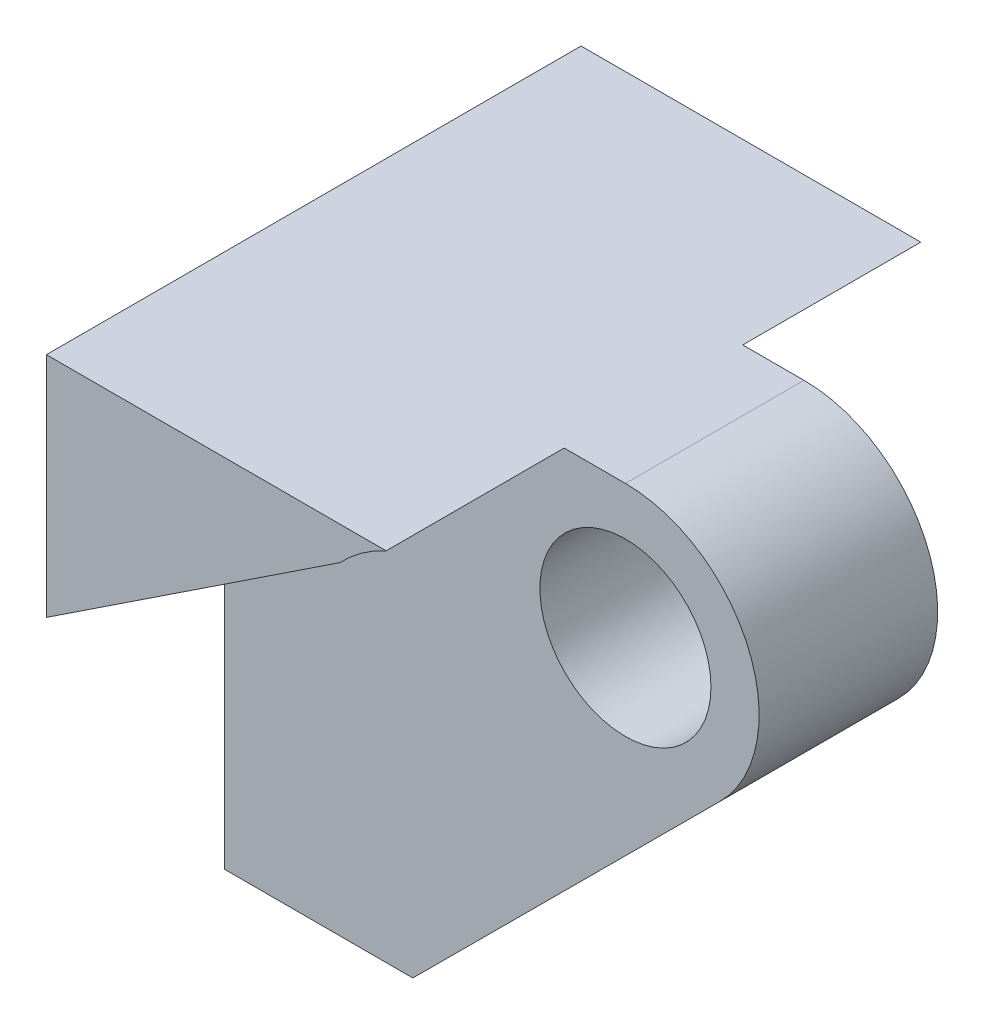
ISO-10303-21;
HEADER;
FILE_DESCRIPTION(('STEP AP214'),'2;1');
FILE_NAME('part.step','',(''),(''),'','','');
FILE_SCHEMA(('AUTOMOTIVE_DESIGN { 1 0 10303 214 1 1 1 1 }'));
ENDSEC;
DATA;
#1=APPLICATION_CONTEXT('core data for automotive mechanical design processes');
#2=APPLICATION_PROTOCOL_DEFINITION('international standard','automotive_design',2000,#1);
#3=PRODUCT_CONTEXT('',#1,'mechanical');
#4=PRODUCT('Part','Part','',(#3));
#5=PRODUCT_RELATED_PRODUCT_CATEGORY('part','',(#4));
#6=PRODUCT_DEFINITION_FORMATION('','',#4);
#7=PRODUCT_DEFINITION_CONTEXT('part definition',#1,'design');
#8=PRODUCT_DEFINITION('design','',#6,#7);
#9=PRODUCT_DEFINITION_SHAPE('','',#8);
#10=(LENGTH_UNIT() NAMED_UNIT(*) SI_UNIT(.MILLI.,.METRE.));
#11=(NAMED_UNIT(*) PLANE_ANGLE_UNIT() SI_UNIT($,.RADIAN.));
#12=(NAMED_UNIT(*) SI_UNIT($,.STERADIAN.) SOLID_ANGLE_UNIT());
#13=UNCERTAINTY_MEASURE_WITH_UNIT(LENGTH_MEASURE(1.E-05),#10,'distance_accuracy_value','');
#14=(GEOMETRIC_REPRESENTATION_CONTEXT(3) GLOBAL_UNCERTAINTY_ASSIGNED_CONTEXT((#13)) GLOBAL_UNIT_ASSIGNED_CONTEXT((#10,
#11,#12)) REPRESENTATION_CONTEXT('',''));
#15=CARTESIAN_POINT('',(0.,0.,0.));
#16=DIRECTION('',(0.,0.,1.));
#17=DIRECTION('',(1.,0.,0.));
#18=AXIS2_PLACEMENT_3D('',#15,#16,#17);
#19=CARTESIAN_POINT('',(0.,0.,5.));
#20=DIRECTION('',(0.,0.,-1.));
#21=DIRECTION('',(-1.,0.,0.));
#22=AXIS2_PLACEMENT_3D('',#19,#20,#21);
#23=CYLINDRICAL_SURFACE('',#22,2.5);
#24=CARTESIAN_POINT('',(0.,0.,1.67));
#25=DIRECTION('',(0.,0.,1.));
#26=DIRECTION('',(1.,0.,0.));
#27=AXIS2_PLACEMENT_3D('',#24,#25,#26);
#28=CIRCLE('',#27,2.5);
#29=CARTESIAN_POINT('',(1.76583977492671,-1.76969203232845,1.67));
#30=VERTEX_POINT('',#29);
#31=CARTESIAN_POINT('',(0.,2.5,1.67));
#32=VERTEX_POINT('',#31);
#33=EDGE_CURVE('E188',#30,#32,#28,.T.);
#34=ORIENTED_EDGE('',*,*,#33,.F.);
#35=DIRECTION('',(0.,0.,-1.));
#36=VECTOR('',#35,1.);
#37=CARTESIAN_POINT('',(1.76583977492671,-1.76969203232845,5.));
#38=LINE('',#37,#36);
#39=CARTESIAN_POINT('',(1.76583977492671,-1.76969203232845,-1.67));
#40=VERTEX_POINT('',#39);
#41=EDGE_CURVE('E195',#30,#40,#38,.T.);
#42=ORIENTED_EDGE('',*,*,#41,.T.);
#43=CARTESIAN_POINT('',(0.,0.,-1.67));
#44=DIRECTION('',(0.,0.,1.));
#45=DIRECTION('',(1.,0.,0.));
#46=AXIS2_PLACEMENT_3D('',#43,#44,#45);
#47=CIRCLE('',#46,2.5);
#48=CARTESIAN_POINT('',(0.,2.5,-1.67));
#49=VERTEX_POINT('',#48);
#50=EDGE_CURVE('E154',#40,#49,#47,.T.);
#51=ORIENTED_EDGE('',*,*,#50,.T.);
#52=DIRECTION('',(0.,0.,-1.));
#53=VECTOR('',#52,1.);
#54=CARTESIAN_POINT('',(0.,2.5,5.));
#55=LINE('',#54,#53);
#56=EDGE_CURVE('E203',#32,#49,#55,.T.);
#57=ORIENTED_EDGE('',*,*,#56,.F.);
#58=EDGE_LOOP('',(#34,#42,#51,#57));
#59=FACE_BOUND('',#58,.T.);
#60=ADVANCED_FACE('F33',(#59),#23,.T.);
#61=CARTESIAN_POINT('',(-7.5,-7.5,5.));
#62=DIRECTION('',(0.,1.,0.));
#63=DIRECTION('',(0.,0.,1.));
#64=AXIS2_PLACEMENT_3D('',#61,#62,#63);
#65=PLANE('',#64);
#66=DIRECTION('',(1.,0.,0.));
#67=VECTOR('',#66,1.);
#68=CARTESIAN_POINT('',(-7.5,-7.5,1.67));
#69=LINE('',#68,#67);
#70=CARTESIAN_POINT('',(-7.5,-7.5,1.67));
#71=VERTEX_POINT('',#70);
#72=CARTESIAN_POINT('',(-3.97696911247503,-7.5,1.67));
#73=VERTEX_POINT('',#72);
#74=EDGE_CURVE('E47',#71,#73,#69,.T.);
#75=ORIENTED_EDGE('',*,*,#74,.F.);
#76=DIRECTION('',(0.,0.,-1.));
#77=VECTOR('',#76,1.);
#78=CARTESIAN_POINT('',(-7.5,-7.5,5.));
#79=LINE('',#78,#77);
#80=CARTESIAN_POINT('',(-7.5,-7.5,-1.67));
#81=VERTEX_POINT('',#80);
#82=EDGE_CURVE('E199',#71,#81,#79,.T.);
#83=ORIENTED_EDGE('',*,*,#82,.T.);
#84=DIRECTION('',(1.,0.,0.));
#85=VECTOR('',#84,1.);
#86=CARTESIAN_POINT('',(-7.5,-7.5,-1.67));
#87=LINE('',#86,#85);
#88=CARTESIAN_POINT('',(-3.97696911247503,-7.5,-1.67));
#89=VERTEX_POINT('',#88);
#90=EDGE_CURVE('E150',#81,#89,#87,.T.);
#91=ORIENTED_EDGE('',*,*,#90,.T.);
#92=DIRECTION('',(0.,0.,-1.));
#93=VECTOR('',#92,1.);
#94=CARTESIAN_POINT('',(-3.97696911247503,-7.5,5.));
#95=LINE('',#94,#93);
#96=EDGE_CURVE('E197',#73,#89,#95,.T.);
#97=ORIENTED_EDGE('',*,*,#96,.F.);
#98=EDGE_LOOP('',(#75,#83,#91,#97));
#99=FACE_BOUND('',#98,.T.);
#100=ADVANCED_FACE('F240',(#99),#65,.F.);
#101=CARTESIAN_POINT('',(-3.97696911247503,-7.5,5.));
#102=DIRECTION('',(-0.706335909970683,0.70787681293138,0.));
#103=DIRECTION('',(-0.70787681293138,-0.706335909970683,0.));
#104=AXIS2_PLACEMENT_3D('',#101,#102,#103);
#105=PLANE('',#104);
#106=DIRECTION('',(0.70787681293138,0.706335909970683,0.));
#107=VECTOR('',#106,1.);
#108=CARTESIAN_POINT('',(-3.97696911247503,-7.5,1.67));
#109=LINE('',#108,#107);
#110=EDGE_CURVE('E183',#73,#30,#109,.T.);
#111=ORIENTED_EDGE('',*,*,#110,.F.);
#112=ORIENTED_EDGE('',*,*,#96,.T.);
#113=DIRECTION('',(0.70787681293138,0.706335909970683,0.));
#114=VECTOR('',#113,1.);
#115=CARTESIAN_POINT('',(-3.97696911247503,-7.5,-1.67));
#116=LINE('',#115,#114);
#117=EDGE_CURVE('E147',#89,#40,#116,.T.);
#118=ORIENTED_EDGE('',*,*,#117,.T.);
#119=ORIENTED_EDGE('',*,*,#41,.F.);
#120=EDGE_LOOP('',(#111,#112,#118,#119));
#121=FACE_BOUND('',#120,.T.);
#122=ADVANCED_FACE('F245',(#121),#105,.F.);
#123=CARTESIAN_POINT('',(0.,0.,5.));
#124=DIRECTION('',(0.,0.,-1.));
#125=DIRECTION('',(-1.,0.,0.));
#126=AXIS2_PLACEMENT_3D('',#123,#124,#125);
#127=CYLINDRICAL_SURFACE('',#126,1.6);
#128=CARTESIAN_POINT('',(0.,0.,1.67));
#129=DIRECTION('',(0.,0.,1.));
#130=DIRECTION('',(1.,0.,0.));
#131=AXIS2_PLACEMENT_3D('',#128,#129,#130);
#132=CIRCLE('',#131,1.6);
#133=CARTESIAN_POINT('',(1.6,0.,1.67));
#134=VERTEX_POINT('',#133);
#135=EDGE_CURVE('E182',#134,#134,#132,.T.);
#136=ORIENTED_EDGE('',*,*,#135,.T.);
#137=EDGE_LOOP('',(#136));
#138=FACE_BOUND('',#137,.T.);
#139=CARTESIAN_POINT('',(0.,0.,-1.67));
#140=DIRECTION('',(0.,0.,1.));
#141=DIRECTION('',(1.,0.,0.));
#142=AXIS2_PLACEMENT_3D('',#139,#140,#141);
#143=CIRCLE('',#142,1.6);
#144=CARTESIAN_POINT('',(1.6,0.,-1.67));
#145=VERTEX_POINT('',#144);
#146=EDGE_CURVE('E137',#145,#145,#143,.T.);
#147=ORIENTED_EDGE('',*,*,#146,.F.);
#148=EDGE_LOOP('',(#147));
#149=FACE_BOUND('',#148,.T.);
#150=ADVANCED_FACE('F255',(#138,#149),#127,.F.);
#151=CARTESIAN_POINT('',(0.,0.,5.));
#152=DIRECTION('',(0.,0.,1.));
#153=DIRECTION('',(1.,0.,0.));
#154=AXIS2_PLACEMENT_3D('',#151,#152,#153);
#155=PLANE('',#154);
#156=CARTESIAN_POINT('',(0.,0.,5.));
#157=DIRECTION('',(0.,0.,1.));
#158=DIRECTION('',(1.,0.,0.));
#159=AXIS2_PLACEMENT_3D('',#156,#157,#158);
#160=CIRCLE('',#159,2.75);
#161=CARTESIAN_POINT('',(-1.14564392373896,2.5,5.));
#162=VERTEX_POINT('',#161);
#163=CARTESIAN_POINT('',(-2.0105472316259,1.876219557888,5.));
#164=VERTEX_POINT('',#163);
#165=EDGE_CURVE('E170',#162,#164,#160,.T.);
#166=ORIENTED_EDGE('',*,*,#165,.F.);
#167=DIRECTION('',(-1.,0.,0.));
#168=VECTOR('',#167,1.);
#169=CARTESIAN_POINT('',(0.,2.5,5.));
#170=LINE('',#169,#168);
#171=CARTESIAN_POINT('',(-7.5,2.5,5.));
#172=VERTEX_POINT('',#171);
#173=EDGE_CURVE('E55',#162,#172,#170,.T.);
#174=ORIENTED_EDGE('',*,*,#173,.T.);
#175=DIRECTION('',(0.,-1.,0.));
#176=VECTOR('',#175,1.);
#177=CARTESIAN_POINT('',(-7.5,2.5,5.));
#178=LINE('',#177,#176);
#179=CARTESIAN_POINT('',(-7.5,-1.7558069392566,5.));
#180=VERTEX_POINT('',#179);
#181=EDGE_CURVE('E193',#172,#180,#178,.T.);
#182=ORIENTED_EDGE('',*,*,#181,.T.);
#183=DIRECTION('',(-0.833981117421096,-0.55179298272546,0.));
#184=VECTOR('',#183,1.);
#185=CARTESIAN_POINT('',(-8.51018569673159,-2.42418343731185,5.));
#186=LINE('',#185,#184);
#187=EDGE_CURVE('E174',#164,#180,#186,.T.);
#188=ORIENTED_EDGE('',*,*,#187,.F.);
#189=EDGE_LOOP('',(#166,#174,#182,#188));
#190=FACE_BOUND('',#189,.T.);
#191=ADVANCED_FACE('F215',(#190),#155,.T.);
#192=CARTESIAN_POINT('',(0.,2.5,5.));
#193=DIRECTION('',(0.,-1.,0.));
#194=DIRECTION('',(1.,0.,0.));
#195=AXIS2_PLACEMENT_3D('',#192,#193,#194);
#196=PLANE('',#195);
#197=ORIENTED_EDGE('',*,*,#173,.F.);
#198=DIRECTION('',(0.,0.,1.));
#199=VECTOR('',#198,1.);
#200=CARTESIAN_POINT('',(-1.14564392373896,2.5,1.67));
#201=LINE('',#200,#199);
#202=CARTESIAN_POINT('',(-1.14564392373896,2.5,1.67));
#203=VERTEX_POINT('',#202);
#204=EDGE_CURVE('E11',#162,#203,#201,.F.);
#205=ORIENTED_EDGE('',*,*,#204,.T.);
#206=DIRECTION('',(-1.,0.,0.));
#207=VECTOR('',#206,1.);
#208=CARTESIAN_POINT('',(0.,2.5,1.67));
#209=LINE('',#208,#207);
#210=EDGE_CURVE('E190',#32,#203,#209,.T.);
#211=ORIENTED_EDGE('',*,*,#210,.F.);
#212=ORIENTED_EDGE('',*,*,#56,.T.);
#213=DIRECTION('',(-1.,0.,0.));
#214=VECTOR('',#213,1.);
#215=CARTESIAN_POINT('',(0.,2.5,-1.67));
#216=LINE('',#215,#214);
#217=CARTESIAN_POINT('',(-1.14564392373896,2.5,-1.67));
#218=VERTEX_POINT('',#217);
#219=EDGE_CURVE('E157',#49,#218,#216,.T.);
#220=ORIENTED_EDGE('',*,*,#219,.T.);
#221=DIRECTION('',(0.,0.,-1.));
#222=VECTOR('',#221,1.);
#223=CARTESIAN_POINT('',(-1.14564392373896,2.5,-1.67));
#224=LINE('',#223,#222);
#225=CARTESIAN_POINT('',(-1.14564392373896,2.5,-5.));
#226=VERTEX_POINT('',#225);
#227=EDGE_CURVE('E140',#226,#218,#224,.F.);
#228=ORIENTED_EDGE('',*,*,#227,.F.);
#229=DIRECTION('',(-1.,0.,0.));
#230=VECTOR('',#229,1.);
#231=CARTESIAN_POINT('',(0.,2.5,-5.));
#232=LINE('',#231,#230);
#233=CARTESIAN_POINT('',(-7.5,2.5,-5.));
#234=VERTEX_POINT('',#233);
#235=EDGE_CURVE('E159',#226,#234,#232,.T.);
#236=ORIENTED_EDGE('',*,*,#235,.T.);
#237=DIRECTION('',(0.,0.,-1.));
#238=VECTOR('',#237,1.);
#239=CARTESIAN_POINT('',(-7.5,2.5,5.));
#240=LINE('',#239,#238);
#241=EDGE_CURVE('E201',#172,#234,#240,.T.);
#242=ORIENTED_EDGE('',*,*,#241,.F.);
#243=EDGE_LOOP('',(#197,#205,#211,#212,#220,#228,#236,#242));
#244=FACE_BOUND('',#243,.T.);
#245=ADVANCED_FACE('F223',(#244),#196,.F.);
#246=CARTESIAN_POINT('',(-7.5,2.5,5.));
#247=DIRECTION('',(1.,0.,0.));
#248=DIRECTION('',(0.,1.,0.));
#249=AXIS2_PLACEMENT_3D('',#246,#247,#248);
#250=PLANE('',#249);
#251=DIRECTION('',(0.,-1.,0.));
#252=VECTOR('',#251,1.);
#253=CARTESIAN_POINT('',(-7.5,2.5,1.67));
#254=LINE('',#253,#252);
#255=CARTESIAN_POINT('',(-7.5,-1.7558069392566,1.67));
#256=VERTEX_POINT('',#255);
#257=EDGE_CURVE('E186',#256,#71,#254,.T.);
#258=ORIENTED_EDGE('',*,*,#257,.F.);
#259=DIRECTION('',(0.,0.,1.));
#260=VECTOR('',#259,1.);
#261=CARTESIAN_POINT('',(-7.5,-1.7558069392566,5.));
#262=LINE('',#261,#260);
#263=EDGE_CURVE('E40',#256,#180,#262,.T.);
#264=ORIENTED_EDGE('',*,*,#263,.T.);
#265=ORIENTED_EDGE('',*,*,#181,.F.);
#266=ORIENTED_EDGE('',*,*,#241,.T.);
#267=DIRECTION('',(0.,-1.,0.));
#268=VECTOR('',#267,1.);
#269=CARTESIAN_POINT('',(-7.5,2.5,-5.));
#270=LINE('',#269,#268);
#271=CARTESIAN_POINT('',(-7.5,-1.7558069392566,-5.));
#272=VERTEX_POINT('',#271);
#273=EDGE_CURVE('E162',#234,#272,#270,.T.);
#274=ORIENTED_EDGE('',*,*,#273,.T.);
#275=DIRECTION('',(0.,0.,-1.));
#276=VECTOR('',#275,1.);
#277=CARTESIAN_POINT('',(-7.5,-1.7558069392566,-5.));
#278=LINE('',#277,#276);
#279=CARTESIAN_POINT('',(-7.5,-1.7558069392566,-1.67));
#280=VERTEX_POINT('',#279);
#281=EDGE_CURVE('E165',#280,#272,#278,.T.);
#282=ORIENTED_EDGE('',*,*,#281,.F.);
#283=DIRECTION('',(0.,-1.,0.));
#284=VECTOR('',#283,1.);
#285=CARTESIAN_POINT('',(-7.5,2.5,-1.67));
#286=LINE('',#285,#284);
#287=EDGE_CURVE('E125',#280,#81,#286,.T.);
#288=ORIENTED_EDGE('',*,*,#287,.T.);
#289=ORIENTED_EDGE('',*,*,#82,.F.);
#290=EDGE_LOOP('',(#258,#264,#265,#266,#274,#282,#288,#289));
#291=FACE_BOUND('',#290,.T.);
#292=ADVANCED_FACE('F210',(#291),#250,.F.);
#293=CARTESIAN_POINT('',(0.,0.,1.67));
#294=DIRECTION('',(0.,0.,1.));
#295=DIRECTION('',(1.,0.,0.));
#296=AXIS2_PLACEMENT_3D('',#293,#294,#295);
#297=CYLINDRICAL_SURFACE('',#296,2.75);
#298=ORIENTED_EDGE('',*,*,#165,.T.);
#299=DIRECTION('',(0.,0.,1.));
#300=VECTOR('',#299,1.);
#301=CARTESIAN_POINT('',(-2.0105472316259,1.876219557888,1.67));
#302=LINE('',#301,#300);
#303=CARTESIAN_POINT('',(-2.0105472316259,1.876219557888,1.67));
#304=VERTEX_POINT('',#303);
#305=EDGE_CURVE('E177',#304,#164,#302,.T.);
#306=ORIENTED_EDGE('',*,*,#305,.F.);
#307=CARTESIAN_POINT('',(0.,0.,1.67));
#308=DIRECTION('',(0.,0.,1.));
#309=DIRECTION('',(1.,0.,0.));
#310=AXIS2_PLACEMENT_3D('',#307,#308,#309);
#311=CIRCLE('',#310,2.75);
#312=EDGE_CURVE('E171',#203,#304,#311,.T.);
#313=ORIENTED_EDGE('',*,*,#312,.F.);
#314=ORIENTED_EDGE('',*,*,#204,.F.);
#315=EDGE_LOOP('',(#298,#306,#313,#314));
#316=FACE_BOUND('',#315,.T.);
#317=ADVANCED_FACE('F220',(#316),#297,.F.);
#318=CARTESIAN_POINT('',(-8.51018569673159,-2.42418343731185,1.67));
#319=DIRECTION('',(-0.55179298272546,0.833981117421096,0.));
#320=DIRECTION('',(-0.833981117421096,-0.55179298272546,0.));
#321=AXIS2_PLACEMENT_3D('',#318,#319,#320);
#322=PLANE('',#321);
#323=DIRECTION('',(-0.833981117421096,-0.55179298272546,0.));
#324=VECTOR('',#323,1.);
#325=CARTESIAN_POINT('',(-8.51018569673159,-2.42418343731185,1.67));
#326=LINE('',#325,#324);
#327=EDGE_CURVE('E173',#304,#256,#326,.T.);
#328=ORIENTED_EDGE('',*,*,#327,.F.);
#329=ORIENTED_EDGE('',*,*,#305,.T.);
#330=ORIENTED_EDGE('',*,*,#187,.T.);
#331=ORIENTED_EDGE('',*,*,#263,.F.);
#332=EDGE_LOOP('',(#328,#329,#330,#331));
#333=FACE_BOUND('',#332,.T.);
#334=ADVANCED_FACE('F216',(#333),#322,.F.);
#335=CARTESIAN_POINT('',(0.,0.,1.67));
#336=DIRECTION('',(0.,0.,1.));
#337=DIRECTION('',(1.,0.,0.));
#338=AXIS2_PLACEMENT_3D('',#335,#336,#337);
#339=PLANE('',#338);
#340=ORIENTED_EDGE('',*,*,#135,.F.);
#341=EDGE_LOOP('',(#340));
#342=FACE_BOUND('',#341,.T.);
#343=ORIENTED_EDGE('',*,*,#210,.T.);
#344=ORIENTED_EDGE('',*,*,#312,.T.);
#345=ORIENTED_EDGE('',*,*,#327,.T.);
#346=ORIENTED_EDGE('',*,*,#257,.T.);
#347=ORIENTED_EDGE('',*,*,#74,.T.);
#348=ORIENTED_EDGE('',*,*,#110,.T.);
#349=ORIENTED_EDGE('',*,*,#33,.T.);
#350=EDGE_LOOP('',(#343,#344,#345,#346,#347,#348,#349));
#351=FACE_BOUND('',#350,.T.);
#352=ADVANCED_FACE('F230',(#342,#351),#339,.T.);
#353=CARTESIAN_POINT('',(0.,0.,-5.));
#354=DIRECTION('',(0.,0.,-1.));
#355=DIRECTION('',(1.,0.,0.));
#356=AXIS2_PLACEMENT_3D('',#353,#354,#355);
#357=PLANE('',#356);
#358=CARTESIAN_POINT('',(0.,0.,-5.));
#359=DIRECTION('',(0.,0.,1.));
#360=DIRECTION('',(1.,0.,0.));
#361=AXIS2_PLACEMENT_3D('',#358,#359,#360);
#362=CIRCLE('',#361,2.75);
#363=CARTESIAN_POINT('',(-2.0105472316259,1.876219557888,-5.));
#364=VERTEX_POINT('',#363);
#365=EDGE_CURVE('E143',#226,#364,#362,.T.);
#366=ORIENTED_EDGE('',*,*,#365,.T.);
#367=DIRECTION('',(-0.833981117421096,-0.55179298272546,0.));
#368=VECTOR('',#367,1.);
#369=CARTESIAN_POINT('',(-8.51018569673159,-2.42418343731185,-5.));
#370=LINE('',#369,#368);
#371=EDGE_CURVE('E133',#364,#272,#370,.T.);
#372=ORIENTED_EDGE('',*,*,#371,.T.);
#373=ORIENTED_EDGE('',*,*,#273,.F.);
#374=ORIENTED_EDGE('',*,*,#235,.F.);
#375=EDGE_LOOP('',(#366,#372,#373,#374));
#376=FACE_BOUND('',#375,.T.);
#377=ADVANCED_FACE('F228',(#376),#357,.T.);
#378=CARTESIAN_POINT('',(0.,0.,-1.67));
#379=DIRECTION('',(0.,0.,-1.));
#380=DIRECTION('',(1.,0.,0.));
#381=AXIS2_PLACEMENT_3D('',#378,#379,#380);
#382=CYLINDRICAL_SURFACE('',#381,2.75);
#383=ORIENTED_EDGE('',*,*,#365,.F.);
#384=ORIENTED_EDGE('',*,*,#227,.T.);
#385=CARTESIAN_POINT('',(0.,0.,-1.67));
#386=DIRECTION('',(0.,0.,1.));
#387=DIRECTION('',(1.,0.,0.));
#388=AXIS2_PLACEMENT_3D('',#385,#386,#387);
#389=CIRCLE('',#388,2.75);
#390=CARTESIAN_POINT('',(-2.0105472316259,1.876219557888,-1.67));
#391=VERTEX_POINT('',#390);
#392=EDGE_CURVE('E121',#218,#391,#389,.T.);
#393=ORIENTED_EDGE('',*,*,#392,.T.);
#394=DIRECTION('',(0.,0.,-1.));
#395=VECTOR('',#394,1.);
#396=CARTESIAN_POINT('',(-2.0105472316259,1.876219557888,-1.67));
#397=LINE('',#396,#395);
#398=EDGE_CURVE('E128',#391,#364,#397,.T.);
#399=ORIENTED_EDGE('',*,*,#398,.T.);
#400=EDGE_LOOP('',(#383,#384,#393,#399));
#401=FACE_BOUND('',#400,.T.);
#402=ADVANCED_FACE('F139',(#401),#382,.F.);
#403=CARTESIAN_POINT('',(-8.51018569673159,-2.42418343731185,-1.67));
#404=DIRECTION('',(-0.55179298272546,0.833981117421096,0.));
#405=DIRECTION('',(-0.833981117421096,-0.55179298272546,0.));
#406=AXIS2_PLACEMENT_3D('',#403,#404,#405);
#407=PLANE('',#406);
#408=DIRECTION('',(-0.833981117421096,-0.55179298272546,0.));
#409=VECTOR('',#408,1.);
#410=CARTESIAN_POINT('',(-8.51018569673159,-2.42418343731185,-1.67));
#411=LINE('',#410,#409);
#412=EDGE_CURVE('E116',#391,#280,#411,.T.);
#413=ORIENTED_EDGE('',*,*,#412,.T.);
#414=ORIENTED_EDGE('',*,*,#281,.T.);
#415=ORIENTED_EDGE('',*,*,#371,.F.);
#416=ORIENTED_EDGE('',*,*,#398,.F.);
#417=EDGE_LOOP('',(#413,#414,#415,#416));
#418=FACE_BOUND('',#417,.T.);
#419=ADVANCED_FACE('F131',(#418),#407,.F.);
#420=CARTESIAN_POINT('',(0.,0.,-1.67));
#421=DIRECTION('',(0.,0.,-1.));
#422=DIRECTION('',(1.,0.,0.));
#423=AXIS2_PLACEMENT_3D('',#420,#421,#422);
#424=PLANE('',#423);
#425=ORIENTED_EDGE('',*,*,#146,.T.);
#426=EDGE_LOOP('',(#425));
#427=FACE_BOUND('',#426,.T.);
#428=ORIENTED_EDGE('',*,*,#219,.F.);
#429=ORIENTED_EDGE('',*,*,#50,.F.);
#430=ORIENTED_EDGE('',*,*,#117,.F.);
#431=ORIENTED_EDGE('',*,*,#90,.F.);
#432=ORIENTED_EDGE('',*,*,#287,.F.);
#433=ORIENTED_EDGE('',*,*,#412,.F.);
#434=ORIENTED_EDGE('',*,*,#392,.F.);
#435=EDGE_LOOP('',(#428,#429,#430,#431,#432,#433,#434));
#436=FACE_BOUND('',#435,.T.);
#437=ADVANCED_FACE('F119',(#427,#436),#424,.T.);
#438=CLOSED_SHELL('',(#60,#100,#122,#150,#191,#245,#292,#317,#334,#352,#377,#402,#419,#437));
#439=MANIFOLD_SOLID_BREP('B2',#438);
#440=ADVANCED_BREP_SHAPE_REPRESENTATION('',(#18,#439),#14);
#441=SHAPE_DEFINITION_REPRESENTATION(#9,#440);
ENDSEC;
END-ISO-10303-21;
